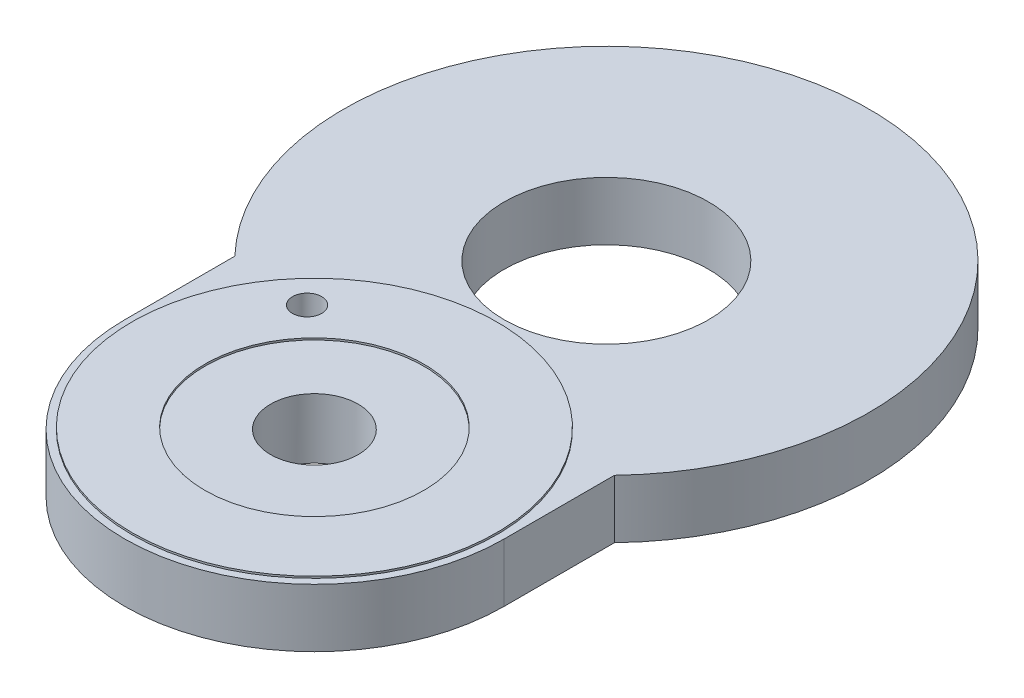
ISO-10303-21;
HEADER;
FILE_DESCRIPTION(('STEP AP214'),'2;1');
FILE_NAME('part.step','',(''),(''),'','','');
FILE_SCHEMA(('AUTOMOTIVE_DESIGN { 1 0 10303 214 1 1 1 1 }'));
ENDSEC;
DATA;
#1=APPLICATION_CONTEXT('core data for automotive mechanical design processes');
#2=APPLICATION_PROTOCOL_DEFINITION('international standard','automotive_design',2000,#1);
#3=PRODUCT_CONTEXT('',#1,'mechanical');
#4=PRODUCT('Part','Part','',(#3));
#5=PRODUCT_RELATED_PRODUCT_CATEGORY('part','',(#4));
#6=PRODUCT_DEFINITION_FORMATION('','',#4);
#7=PRODUCT_DEFINITION_CONTEXT('part definition',#1,'design');
#8=PRODUCT_DEFINITION('design','',#6,#7);
#9=PRODUCT_DEFINITION_SHAPE('','',#8);
#10=(LENGTH_UNIT() NAMED_UNIT(*) SI_UNIT(.MILLI.,.METRE.));
#11=(NAMED_UNIT(*) PLANE_ANGLE_UNIT() SI_UNIT($,.RADIAN.));
#12=(NAMED_UNIT(*) SI_UNIT($,.STERADIAN.) SOLID_ANGLE_UNIT());
#13=UNCERTAINTY_MEASURE_WITH_UNIT(LENGTH_MEASURE(1.E-05),#10,'distance_accuracy_value','');
#14=(GEOMETRIC_REPRESENTATION_CONTEXT(3) GLOBAL_UNCERTAINTY_ASSIGNED_CONTEXT((#13)) GLOBAL_UNIT_ASSIGNED_CONTEXT((#10,
#11,#12)) REPRESENTATION_CONTEXT('',''));
#15=CARTESIAN_POINT('',(0.,0.,0.));
#16=DIRECTION('',(0.,0.,1.));
#17=DIRECTION('',(1.,0.,0.));
#18=AXIS2_PLACEMENT_3D('',#15,#16,#17);
#19=CARTESIAN_POINT('',(0.,0.,0.));
#20=DIRECTION('',(0.,1.,0.));
#21=DIRECTION('',(0.,0.,1.));
#22=AXIS2_PLACEMENT_3D('',#19,#20,#21);
#23=PLANE('',#22);
#24=CARTESIAN_POINT('',(0.,0.,-4.));
#25=DIRECTION('',(0.,1.,0.));
#26=DIRECTION('',(0.,0.,1.));
#27=AXIS2_PLACEMENT_3D('',#24,#25,#26);
#28=CIRCLE('',#27,1.4);
#29=CARTESIAN_POINT('',(0.,0.,-2.6));
#30=VERTEX_POINT('',#29);
#31=EDGE_CURVE('E151',#30,#30,#28,.T.);
#32=ORIENTED_EDGE('',*,*,#31,.T.);
#33=EDGE_LOOP('',(#32));
#34=FACE_BOUND('',#33,.T.);
#35=CARTESIAN_POINT('',(0.,0.,0.));
#36=DIRECTION('',(0.,1.,0.));
#37=DIRECTION('',(0.,0.,1.));
#38=AXIS2_PLACEMENT_3D('',#35,#36,#37);
#39=CIRCLE('',#38,2.6);
#40=CARTESIAN_POINT('',(-2.6,0.,0.));
#41=VERTEX_POINT('',#40);
#42=CARTESIAN_POINT('',(2.6,0.,0.));
#43=VERTEX_POINT('',#42);
#44=EDGE_CURVE('E155',#41,#43,#39,.T.);
#45=ORIENTED_EDGE('',*,*,#44,.F.);
#46=DIRECTION('',(0.,0.,1.));
#47=VECTOR('',#46,1.);
#48=CARTESIAN_POINT('',(-2.6,0.,0.));
#49=LINE('',#48,#47);
#50=CARTESIAN_POINT('',(-2.6,0.,-1.51002008040225));
#51=VERTEX_POINT('',#50);
#52=EDGE_CURVE('E162',#51,#41,#49,.T.);
#53=ORIENTED_EDGE('',*,*,#52,.F.);
#54=CARTESIAN_POINT('',(0.,0.,-4.));
#55=DIRECTION('',(0.,1.,0.));
#56=DIRECTION('',(0.,0.,1.));
#57=AXIS2_PLACEMENT_3D('',#54,#55,#56);
#58=CIRCLE('',#57,3.6);
#59=CARTESIAN_POINT('',(2.6,0.,-1.51002008040225));
#60=VERTEX_POINT('',#59);
#61=EDGE_CURVE('E173',#60,#51,#58,.T.);
#62=ORIENTED_EDGE('',*,*,#61,.F.);
#63=DIRECTION('',(0.,0.,-1.));
#64=VECTOR('',#63,1.);
#65=CARTESIAN_POINT('',(2.6,0.,0.));
#66=LINE('',#65,#64);
#67=EDGE_CURVE('E171',#43,#60,#66,.T.);
#68=ORIENTED_EDGE('',*,*,#67,.F.);
#69=EDGE_LOOP('',(#45,#53,#62,#68));
#70=FACE_BOUND('',#69,.T.);
#71=CARTESIAN_POINT('',(0.,0.,0.));
#72=DIRECTION('',(0.,-1.,0.));
#73=DIRECTION('',(0.,0.,-1.));
#74=AXIS2_PLACEMENT_3D('',#71,#72,#73);
#75=CIRCLE('',#74,1.);
#76=CARTESIAN_POINT('',(0.77580640105645,0.,-0.63097102));
#77=VERTEX_POINT('',#76);
#78=CARTESIAN_POINT('',(-0.445093543501311,0.,-0.89548408));
#79=VERTEX_POINT('',#78);
#80=EDGE_CURVE('E130',#77,#79,#75,.T.);
#81=ORIENTED_EDGE('',*,*,#80,.F.);
#82=CARTESIAN_POINT('',(0.,0.,-4.));
#83=DIRECTION('',(0.,-1.,0.));
#84=DIRECTION('',(0.,0.,-1.));
#85=AXIS2_PLACEMENT_3D('',#82,#83,#84);
#86=CIRCLE('',#85,3.4572);
#87=CARTESIAN_POINT('',(-1.72764046620417,0.,-1.00542319191278));
#88=VERTEX_POINT('',#87);
#89=EDGE_CURVE('E260',#88,#77,#86,.T.);
#90=ORIENTED_EDGE('',*,*,#89,.F.);
#91=CARTESIAN_POINT('',(-1.49916736046873,0.,-1.4014432418542));
#92=DIRECTION('',(0.,-1.,0.));
#93=DIRECTION('',(0.,0.,-1.));
#94=AXIS2_PLACEMENT_3D('',#91,#92,#93);
#95=CIRCLE('',#94,0.4572);
#96=CARTESIAN_POINT('',(-1.2706942547333,0.,-1.79746329179562));
#97=VERTEX_POINT('',#96);
#98=EDGE_CURVE('E263',#97,#88,#95,.T.);
#99=ORIENTED_EDGE('',*,*,#98,.F.);
#100=CARTESIAN_POINT('',(0.,0.,-4.));
#101=DIRECTION('',(0.,-1.,0.));
#102=DIRECTION('',(0.,0.,-1.));
#103=AXIS2_PLACEMENT_3D('',#100,#101,#102);
#104=CIRCLE('',#103,2.5428);
#105=CARTESIAN_POINT('',(0.,0.,-1.4572));
#106=VERTEX_POINT('',#105);
#107=EDGE_CURVE('E57',#97,#106,#104,.T.);
#108=ORIENTED_EDGE('',*,*,#107,.T.);
#109=CARTESIAN_POINT('',(0.,0.,-1.));
#110=DIRECTION('',(0.,-1.,0.));
#111=DIRECTION('',(0.,0.,-1.));
#112=AXIS2_PLACEMENT_3D('',#109,#110,#111);
#113=CIRCLE('',#112,0.4572);
#114=EDGE_CURVE('E52',#79,#106,#113,.T.);
#115=ORIENTED_EDGE('',*,*,#114,.F.);
#116=EDGE_LOOP('',(#81,#90,#99,#108,#115));
#117=FACE_BOUND('',#116,.T.);
#118=ADVANCED_FACE('F37',(#34,#70,#117),#23,.F.);
#119=CARTESIAN_POINT('',(0.,0.8,0.));
#120=DIRECTION('',(0.,1.,0.));
#121=DIRECTION('',(0.,0.,1.));
#122=AXIS2_PLACEMENT_3D('',#119,#120,#121);
#123=PLANE('',#122);
#124=CARTESIAN_POINT('',(0.,0.8,0.));
#125=DIRECTION('',(0.,1.,0.));
#126=DIRECTION('',(0.,0.,1.));
#127=AXIS2_PLACEMENT_3D('',#124,#125,#126);
#128=CIRCLE('',#127,2.6);
#129=CARTESIAN_POINT('',(-2.6,0.8,0.));
#130=VERTEX_POINT('',#129);
#131=CARTESIAN_POINT('',(2.6,0.8,0.));
#132=VERTEX_POINT('',#131);
#133=EDGE_CURVE('E158',#130,#132,#128,.T.);
#134=ORIENTED_EDGE('',*,*,#133,.T.);
#135=DIRECTION('',(0.,0.,-1.));
#136=VECTOR('',#135,1.);
#137=CARTESIAN_POINT('',(2.6,0.8,0.));
#138=LINE('',#137,#136);
#139=CARTESIAN_POINT('',(2.6,0.8,-1.51002008040225));
#140=VERTEX_POINT('',#139);
#141=EDGE_CURVE('E161',#132,#140,#138,.T.);
#142=ORIENTED_EDGE('',*,*,#141,.T.);
#143=CARTESIAN_POINT('',(0.,0.8,-4.));
#144=DIRECTION('',(0.,1.,0.));
#145=DIRECTION('',(0.,0.,1.));
#146=AXIS2_PLACEMENT_3D('',#143,#144,#145);
#147=CIRCLE('',#146,3.6);
#148=CARTESIAN_POINT('',(-2.6,0.8,-1.51002008040225));
#149=VERTEX_POINT('',#148);
#150=EDGE_CURVE('E164',#140,#149,#147,.T.);
#151=ORIENTED_EDGE('',*,*,#150,.T.);
#152=DIRECTION('',(0.,0.,1.));
#153=VECTOR('',#152,1.);
#154=CARTESIAN_POINT('',(-2.6,0.8,0.));
#155=LINE('',#154,#153);
#156=EDGE_CURVE('E166',#149,#130,#155,.T.);
#157=ORIENTED_EDGE('',*,*,#156,.T.);
#158=EDGE_LOOP('',(#134,#142,#151,#157));
#159=FACE_BOUND('',#158,.T.);
#160=CARTESIAN_POINT('',(0.,0.8,-4.));
#161=DIRECTION('',(0.,1.,0.));
#162=DIRECTION('',(0.,0.,1.));
#163=AXIS2_PLACEMENT_3D('',#160,#161,#162);
#164=CIRCLE('',#163,1.4);
#165=CARTESIAN_POINT('',(0.,0.8,-2.6));
#166=VERTEX_POINT('',#165);
#167=EDGE_CURVE('E152',#166,#166,#164,.T.);
#168=ORIENTED_EDGE('',*,*,#167,.F.);
#169=EDGE_LOOP('',(#168));
#170=FACE_BOUND('',#169,.T.);
#171=CARTESIAN_POINT('',(0.,0.8,0.));
#172=DIRECTION('',(0.,1.,0.));
#173=DIRECTION('',(0.,0.,1.));
#174=AXIS2_PLACEMENT_3D('',#171,#172,#173);
#175=CIRCLE('',#174,2.5);
#176=CARTESIAN_POINT('',(0.,0.8,2.5));
#177=VERTEX_POINT('',#176);
#178=EDGE_CURVE('E142',#177,#177,#175,.T.);
#179=ORIENTED_EDGE('',*,*,#178,.F.);
#180=EDGE_LOOP('',(#179));
#181=FACE_BOUND('',#180,.T.);
#182=ADVANCED_FACE('F203',(#159,#170,#181),#123,.T.);
#183=CARTESIAN_POINT('',(0.,0.8,0.));
#184=DIRECTION('',(0.,1.,0.));
#185=DIRECTION('',(0.,0.,1.));
#186=AXIS2_PLACEMENT_3D('',#183,#184,#185);
#187=CIRCLE('',#186,1.5);
#188=CARTESIAN_POINT('',(0.,0.8,1.5));
#189=VERTEX_POINT('',#188);
#190=EDGE_CURVE('E11',#189,#189,#187,.F.);
#191=ORIENTED_EDGE('',*,*,#190,.F.);
#192=EDGE_LOOP('',(#191));
#193=FACE_BOUND('',#192,.T.);
#194=CARTESIAN_POINT('',(0.,0.8,0.));
#195=DIRECTION('',(0.,1.,0.));
#196=DIRECTION('',(0.,0.,1.));
#197=AXIS2_PLACEMENT_3D('',#194,#195,#196);
#198=CIRCLE('',#197,0.6);
#199=CARTESIAN_POINT('',(0.,0.8,0.6));
#200=VERTEX_POINT('',#199);
#201=EDGE_CURVE('E146',#200,#200,#198,.T.);
#202=ORIENTED_EDGE('',*,*,#201,.F.);
#203=EDGE_LOOP('',(#202));
#204=FACE_BOUND('',#203,.T.);
#205=ADVANCED_FACE('F206',(#193,#204),#123,.T.);
#206=CARTESIAN_POINT('',(0.,0.8,0.));
#207=DIRECTION('',(0.,-1.,0.));
#208=DIRECTION('',(0.,0.,-1.));
#209=AXIS2_PLACEMENT_3D('',#206,#207,#208);
#210=CYLINDRICAL_SURFACE('',#209,2.6);
#211=ORIENTED_EDGE('',*,*,#44,.T.);
#212=DIRECTION('',(0.,-1.,0.));
#213=VECTOR('',#212,1.);
#214=CARTESIAN_POINT('',(2.6,0.8,0.));
#215=LINE('',#214,#213);
#216=EDGE_CURVE('E45',#132,#43,#215,.T.);
#217=ORIENTED_EDGE('',*,*,#216,.F.);
#218=ORIENTED_EDGE('',*,*,#133,.F.);
#219=DIRECTION('',(0.,-1.,0.));
#220=VECTOR('',#219,1.);
#221=CARTESIAN_POINT('',(-2.6,0.8,0.));
#222=LINE('',#221,#220);
#223=EDGE_CURVE('E168',#130,#41,#222,.T.);
#224=ORIENTED_EDGE('',*,*,#223,.T.);
#225=EDGE_LOOP('',(#211,#217,#218,#224));
#226=FACE_BOUND('',#225,.T.);
#227=ADVANCED_FACE('F39',(#226),#210,.T.);
#228=CARTESIAN_POINT('',(2.6,0.8,0.));
#229=DIRECTION('',(-1.,0.,0.));
#230=DIRECTION('',(0.,0.,1.));
#231=AXIS2_PLACEMENT_3D('',#228,#229,#230);
#232=PLANE('',#231);
#233=ORIENTED_EDGE('',*,*,#67,.T.);
#234=DIRECTION('',(0.,-1.,0.));
#235=VECTOR('',#234,1.);
#236=CARTESIAN_POINT('',(2.6,0.8,-1.51002008040225));
#237=LINE('',#236,#235);
#238=EDGE_CURVE('E181',#140,#60,#237,.T.);
#239=ORIENTED_EDGE('',*,*,#238,.F.);
#240=ORIENTED_EDGE('',*,*,#141,.F.);
#241=ORIENTED_EDGE('',*,*,#216,.T.);
#242=EDGE_LOOP('',(#233,#239,#240,#241));
#243=FACE_BOUND('',#242,.T.);
#244=ADVANCED_FACE('F186',(#243),#232,.F.);
#245=CARTESIAN_POINT('',(0.,0.8,-4.));
#246=DIRECTION('',(0.,-1.,0.));
#247=DIRECTION('',(0.,0.,-1.));
#248=AXIS2_PLACEMENT_3D('',#245,#246,#247);
#249=CYLINDRICAL_SURFACE('',#248,3.6);
#250=ORIENTED_EDGE('',*,*,#61,.T.);
#251=DIRECTION('',(0.,-1.,0.));
#252=VECTOR('',#251,1.);
#253=CARTESIAN_POINT('',(-2.6,0.8,-1.51002008040225));
#254=LINE('',#253,#252);
#255=EDGE_CURVE('E178',#149,#51,#254,.T.);
#256=ORIENTED_EDGE('',*,*,#255,.F.);
#257=ORIENTED_EDGE('',*,*,#150,.F.);
#258=ORIENTED_EDGE('',*,*,#238,.T.);
#259=EDGE_LOOP('',(#250,#256,#257,#258));
#260=FACE_BOUND('',#259,.T.);
#261=ADVANCED_FACE('F197',(#260),#249,.T.);
#262=CARTESIAN_POINT('',(-2.6,0.8,0.));
#263=DIRECTION('',(1.,0.,0.));
#264=DIRECTION('',(0.,0.,-1.));
#265=AXIS2_PLACEMENT_3D('',#262,#263,#264);
#266=PLANE('',#265);
#267=ORIENTED_EDGE('',*,*,#52,.T.);
#268=ORIENTED_EDGE('',*,*,#223,.F.);
#269=ORIENTED_EDGE('',*,*,#156,.F.);
#270=ORIENTED_EDGE('',*,*,#255,.T.);
#271=EDGE_LOOP('',(#267,#268,#269,#270));
#272=FACE_BOUND('',#271,.T.);
#273=ADVANCED_FACE('F201',(#272),#266,.F.);
#274=CARTESIAN_POINT('',(0.,0.8,-4.));
#275=DIRECTION('',(0.,-1.,0.));
#276=DIRECTION('',(0.,0.,-1.));
#277=AXIS2_PLACEMENT_3D('',#274,#275,#276);
#278=CYLINDRICAL_SURFACE('',#277,1.4);
#279=ORIENTED_EDGE('',*,*,#167,.T.);
#280=EDGE_LOOP('',(#279));
#281=FACE_BOUND('',#280,.T.);
#282=ORIENTED_EDGE('',*,*,#31,.F.);
#283=EDGE_LOOP('',(#282));
#284=FACE_BOUND('',#283,.T.);
#285=ADVANCED_FACE('F238',(#281,#284),#278,.F.);
#286=CARTESIAN_POINT('',(-1.5,0.,-1.4));
#287=DIRECTION('',(0.,1.,0.));
#288=DIRECTION('',(0.,0.,1.));
#289=AXIS2_PLACEMENT_3D('',#286,#287,#288);
#290=CYLINDRICAL_SURFACE('',#289,0.2);
#291=CARTESIAN_POINT('',(-1.5,0.8254,-1.4));
#292=DIRECTION('',(0.,1.,0.));
#293=DIRECTION('',(0.,0.,1.));
#294=AXIS2_PLACEMENT_3D('',#291,#292,#293);
#295=CIRCLE('',#294,0.2);
#296=CARTESIAN_POINT('',(-1.5,0.8254,-1.2));
#297=VERTEX_POINT('',#296);
#298=EDGE_CURVE('E131',#297,#297,#295,.T.);
#299=ORIENTED_EDGE('',*,*,#298,.T.);
#300=EDGE_LOOP('',(#299));
#301=FACE_BOUND('',#300,.T.);
#302=CARTESIAN_POINT('',(-1.5,-0.0254,-1.4));
#303=DIRECTION('',(0.,-1.,0.));
#304=DIRECTION('',(0.,0.,-1.));
#305=AXIS2_PLACEMENT_3D('',#302,#303,#304);
#306=CIRCLE('',#305,0.2);
#307=CARTESIAN_POINT('',(-1.5,-0.0254,-1.6));
#308=VERTEX_POINT('',#307);
#309=EDGE_CURVE('E270',#308,#308,#306,.F.);
#310=ORIENTED_EDGE('',*,*,#309,.F.);
#311=EDGE_LOOP('',(#310));
#312=FACE_BOUND('',#311,.T.);
#313=ADVANCED_FACE('F256',(#301,#312),#290,.F.);
#314=CARTESIAN_POINT('',(0.,0.,0.));
#315=DIRECTION('',(0.,1.,0.));
#316=DIRECTION('',(0.,0.,1.));
#317=AXIS2_PLACEMENT_3D('',#314,#315,#316);
#318=CYLINDRICAL_SURFACE('',#317,0.6);
#319=ORIENTED_EDGE('',*,*,#201,.T.);
#320=EDGE_LOOP('',(#319));
#321=FACE_BOUND('',#320,.T.);
#322=CARTESIAN_POINT('',(0.,-0.0254,0.));
#323=DIRECTION('',(0.,-1.,0.));
#324=DIRECTION('',(0.,0.,-1.));
#325=AXIS2_PLACEMENT_3D('',#322,#323,#324);
#326=CIRCLE('',#325,0.6);
#327=CARTESIAN_POINT('',(0.,-0.0254,-0.6));
#328=VERTEX_POINT('',#327);
#329=EDGE_CURVE('E127',#328,#328,#326,.F.);
#330=ORIENTED_EDGE('',*,*,#329,.F.);
#331=EDGE_LOOP('',(#330));
#332=FACE_BOUND('',#331,.T.);
#333=ADVANCED_FACE('F224',(#321,#332),#318,.F.);
#334=CARTESIAN_POINT('',(0.,0.8254,0.));
#335=DIRECTION('',(0.,1.,0.));
#336=DIRECTION('',(0.,0.,1.));
#337=AXIS2_PLACEMENT_3D('',#334,#335,#336);
#338=PLANE('',#337);
#339=CARTESIAN_POINT('',(0.,0.8254,0.));
#340=DIRECTION('',(0.,1.,0.));
#341=DIRECTION('',(0.,0.,1.));
#342=AXIS2_PLACEMENT_3D('',#339,#340,#341);
#343=CIRCLE('',#342,1.5);
#344=CARTESIAN_POINT('',(0.,0.8254,1.5));
#345=VERTEX_POINT('',#344);
#346=EDGE_CURVE('E134',#345,#345,#343,.T.);
#347=ORIENTED_EDGE('',*,*,#346,.F.);
#348=EDGE_LOOP('',(#347));
#349=FACE_BOUND('',#348,.T.);
#350=CARTESIAN_POINT('',(0.,0.8254,0.));
#351=DIRECTION('',(0.,1.,0.));
#352=DIRECTION('',(0.,0.,1.));
#353=AXIS2_PLACEMENT_3D('',#350,#351,#352);
#354=CIRCLE('',#353,2.5);
#355=CARTESIAN_POINT('',(0.,0.8254,2.5));
#356=VERTEX_POINT('',#355);
#357=EDGE_CURVE('E143',#356,#356,#354,.T.);
#358=ORIENTED_EDGE('',*,*,#357,.T.);
#359=EDGE_LOOP('',(#358));
#360=FACE_BOUND('',#359,.T.);
#361=ORIENTED_EDGE('',*,*,#298,.F.);
#362=EDGE_LOOP('',(#361));
#363=FACE_BOUND('',#362,.T.);
#364=ADVANCED_FACE('F215',(#349,#360,#363),#338,.T.);
#365=CARTESIAN_POINT('',(0.,0.8254,0.));
#366=DIRECTION('',(0.,-1.,0.));
#367=DIRECTION('',(0.,0.,-1.));
#368=AXIS2_PLACEMENT_3D('',#365,#366,#367);
#369=CYLINDRICAL_SURFACE('',#368,2.5);
#370=ORIENTED_EDGE('',*,*,#357,.F.);
#371=EDGE_LOOP('',(#370));
#372=FACE_BOUND('',#371,.T.);
#373=ORIENTED_EDGE('',*,*,#178,.T.);
#374=EDGE_LOOP('',(#373));
#375=FACE_BOUND('',#374,.T.);
#376=ADVANCED_FACE('F212',(#372,#375),#369,.T.);
#377=CARTESIAN_POINT('',(0.,0.8254,0.));
#378=DIRECTION('',(0.,-1.,0.));
#379=DIRECTION('',(0.,0.,-1.));
#380=AXIS2_PLACEMENT_3D('',#377,#378,#379);
#381=CYLINDRICAL_SURFACE('',#380,1.5);
#382=ORIENTED_EDGE('',*,*,#346,.T.);
#383=EDGE_LOOP('',(#382));
#384=FACE_BOUND('',#383,.T.);
#385=ORIENTED_EDGE('',*,*,#190,.T.);
#386=EDGE_LOOP('',(#385));
#387=FACE_BOUND('',#386,.T.);
#388=ADVANCED_FACE('F214',(#384,#387),#381,.F.);
#389=CARTESIAN_POINT('',(0.,-0.0254,0.));
#390=DIRECTION('',(0.,1.,0.));
#391=DIRECTION('',(0.,0.,1.));
#392=AXIS2_PLACEMENT_3D('',#389,#390,#391);
#393=CYLINDRICAL_SURFACE('',#392,1.);
#394=ORIENTED_EDGE('',*,*,#80,.T.);
#395=DIRECTION('',(0.,1.,0.));
#396=VECTOR('',#395,1.);
#397=CARTESIAN_POINT('',(-0.445093543501311,-0.0254,-0.89548408));
#398=LINE('',#397,#396);
#399=CARTESIAN_POINT('',(-0.445093543501311,-0.0254,-0.89548408));
#400=VERTEX_POINT('',#399);
#401=EDGE_CURVE('E110',#400,#79,#398,.T.);
#402=ORIENTED_EDGE('',*,*,#401,.F.);
#403=CARTESIAN_POINT('',(0.,-0.0254,0.));
#404=DIRECTION('',(0.,-1.,0.));
#405=DIRECTION('',(0.,0.,-1.));
#406=AXIS2_PLACEMENT_3D('',#403,#404,#405);
#407=CIRCLE('',#406,1.);
#408=CARTESIAN_POINT('',(0.77580640105645,-0.0254,-0.63097102));
#409=VERTEX_POINT('',#408);
#410=EDGE_CURVE('E117',#409,#400,#407,.T.);
#411=ORIENTED_EDGE('',*,*,#410,.F.);
#412=DIRECTION('',(0.,1.,0.));
#413=VECTOR('',#412,1.);
#414=CARTESIAN_POINT('',(0.77580640105645,-0.0254,-0.63097102));
#415=LINE('',#414,#413);
#416=EDGE_CURVE('E273',#409,#77,#415,.T.);
#417=ORIENTED_EDGE('',*,*,#416,.T.);
#418=EDGE_LOOP('',(#394,#402,#411,#417));
#419=FACE_BOUND('',#418,.T.);
#420=ADVANCED_FACE('F129',(#419),#393,.T.);
#421=CARTESIAN_POINT('',(0.,-0.0254,-1.));
#422=DIRECTION('',(0.,1.,0.));
#423=DIRECTION('',(0.,0.,1.));
#424=AXIS2_PLACEMENT_3D('',#421,#422,#423);
#425=CYLINDRICAL_SURFACE('',#424,0.4572);
#426=ORIENTED_EDGE('',*,*,#114,.T.);
#427=DIRECTION('',(0.,1.,0.));
#428=VECTOR('',#427,1.);
#429=CARTESIAN_POINT('',(0.,-0.0254,-1.4572));
#430=LINE('',#429,#428);
#431=CARTESIAN_POINT('',(0.,-0.0254,-1.4572));
#432=VERTEX_POINT('',#431);
#433=EDGE_CURVE('E112',#432,#106,#430,.T.);
#434=ORIENTED_EDGE('',*,*,#433,.F.);
#435=CARTESIAN_POINT('',(0.,-0.0254,-1.));
#436=DIRECTION('',(0.,-1.,0.));
#437=DIRECTION('',(0.,0.,-1.));
#438=AXIS2_PLACEMENT_3D('',#435,#436,#437);
#439=CIRCLE('',#438,0.4572);
#440=EDGE_CURVE('E106',#400,#432,#439,.T.);
#441=ORIENTED_EDGE('',*,*,#440,.F.);
#442=ORIENTED_EDGE('',*,*,#401,.T.);
#443=EDGE_LOOP('',(#426,#434,#441,#442));
#444=FACE_BOUND('',#443,.T.);
#445=ADVANCED_FACE('F108',(#444),#425,.T.);
#446=CARTESIAN_POINT('',(0.,-0.0254,-4.));
#447=DIRECTION('',(0.,1.,0.));
#448=DIRECTION('',(0.,0.,1.));
#449=AXIS2_PLACEMENT_3D('',#446,#447,#448);
#450=CYLINDRICAL_SURFACE('',#449,2.5428);
#451=ORIENTED_EDGE('',*,*,#107,.F.);
#452=DIRECTION('',(0.,1.,0.));
#453=VECTOR('',#452,1.);
#454=CARTESIAN_POINT('',(-1.2706942547333,-0.0254,-1.79746329179562));
#455=LINE('',#454,#453);
#456=CARTESIAN_POINT('',(-1.2706942547333,-0.0254,-1.79746329179562));
#457=VERTEX_POINT('',#456);
#458=EDGE_CURVE('E136',#457,#97,#455,.T.);
#459=ORIENTED_EDGE('',*,*,#458,.F.);
#460=CARTESIAN_POINT('',(0.,-0.0254,-4.));
#461=DIRECTION('',(0.,-1.,0.));
#462=DIRECTION('',(0.,0.,-1.));
#463=AXIS2_PLACEMENT_3D('',#460,#461,#462);
#464=CIRCLE('',#463,2.5428);
#465=EDGE_CURVE('E116',#457,#432,#464,.T.);
#466=ORIENTED_EDGE('',*,*,#465,.T.);
#467=ORIENTED_EDGE('',*,*,#433,.T.);
#468=EDGE_LOOP('',(#451,#459,#466,#467));
#469=FACE_BOUND('',#468,.T.);
#470=ADVANCED_FACE('F288',(#469),#450,.F.);
#471=CARTESIAN_POINT('',(-1.49916736046873,-0.0254,-1.4014432418542));
#472=DIRECTION('',(0.,1.,0.));
#473=DIRECTION('',(0.,0.,1.));
#474=AXIS2_PLACEMENT_3D('',#471,#472,#473);
#475=CYLINDRICAL_SURFACE('',#474,0.4572);
#476=ORIENTED_EDGE('',*,*,#98,.T.);
#477=DIRECTION('',(0.,1.,0.));
#478=VECTOR('',#477,1.);
#479=CARTESIAN_POINT('',(-1.72764046620417,-0.0254,-1.00542319191278));
#480=LINE('',#479,#478);
#481=CARTESIAN_POINT('',(-1.72764046620417,-0.0254,-1.00542319191278));
#482=VERTEX_POINT('',#481);
#483=EDGE_CURVE('E280',#482,#88,#480,.T.);
#484=ORIENTED_EDGE('',*,*,#483,.F.);
#485=CARTESIAN_POINT('',(-1.49916736046873,-0.0254,-1.4014432418542));
#486=DIRECTION('',(0.,-1.,0.));
#487=DIRECTION('',(0.,0.,-1.));
#488=AXIS2_PLACEMENT_3D('',#485,#486,#487);
#489=CIRCLE('',#488,0.4572);
#490=EDGE_CURVE('E267',#457,#482,#489,.T.);
#491=ORIENTED_EDGE('',*,*,#490,.F.);
#492=ORIENTED_EDGE('',*,*,#458,.T.);
#493=EDGE_LOOP('',(#476,#484,#491,#492));
#494=FACE_BOUND('',#493,.T.);
#495=ADVANCED_FACE('F285',(#494),#475,.T.);
#496=CARTESIAN_POINT('',(0.,-0.0254,-4.));
#497=DIRECTION('',(0.,1.,0.));
#498=DIRECTION('',(0.,0.,1.));
#499=AXIS2_PLACEMENT_3D('',#496,#497,#498);
#500=CYLINDRICAL_SURFACE('',#499,3.4572);
#501=ORIENTED_EDGE('',*,*,#89,.T.);
#502=ORIENTED_EDGE('',*,*,#416,.F.);
#503=CARTESIAN_POINT('',(0.,-0.0254,-4.));
#504=DIRECTION('',(0.,-1.,0.));
#505=DIRECTION('',(0.,0.,-1.));
#506=AXIS2_PLACEMENT_3D('',#503,#504,#505);
#507=CIRCLE('',#506,3.4572);
#508=EDGE_CURVE('E123',#482,#409,#507,.T.);
#509=ORIENTED_EDGE('',*,*,#508,.F.);
#510=ORIENTED_EDGE('',*,*,#483,.T.);
#511=EDGE_LOOP('',(#501,#502,#509,#510));
#512=FACE_BOUND('',#511,.T.);
#513=ADVANCED_FACE('F290',(#512),#500,.T.);
#514=CARTESIAN_POINT('',(0.,-0.0254,0.));
#515=DIRECTION('',(0.,-1.,0.));
#516=DIRECTION('',(0.,0.,-1.));
#517=AXIS2_PLACEMENT_3D('',#514,#515,#516);
#518=PLANE('',#517);
#519=ORIENTED_EDGE('',*,*,#329,.T.);
#520=EDGE_LOOP('',(#519));
#521=FACE_BOUND('',#520,.T.);
#522=ORIENTED_EDGE('',*,*,#410,.T.);
#523=ORIENTED_EDGE('',*,*,#440,.T.);
#524=ORIENTED_EDGE('',*,*,#465,.F.);
#525=ORIENTED_EDGE('',*,*,#490,.T.);
#526=ORIENTED_EDGE('',*,*,#508,.T.);
#527=EDGE_LOOP('',(#522,#523,#524,#525,#526));
#528=FACE_BOUND('',#527,.T.);
#529=ORIENTED_EDGE('',*,*,#309,.T.);
#530=EDGE_LOOP('',(#529));
#531=FACE_BOUND('',#530,.T.);
#532=ADVANCED_FACE('F120',(#521,#528,#531),#518,.T.);
#533=CLOSED_SHELL('',(#118,#182,#205,#227,#244,#261,#273,#285,#313,#333,#364,#376,#388,#420,
#445,#470,#495,#513,#532));
#534=MANIFOLD_SOLID_BREP('B2',#533);
#535=ADVANCED_BREP_SHAPE_REPRESENTATION('',(#18,#534),#14);
#536=SHAPE_DEFINITION_REPRESENTATION(#9,#535);
ENDSEC;
END-ISO-10303-21;
